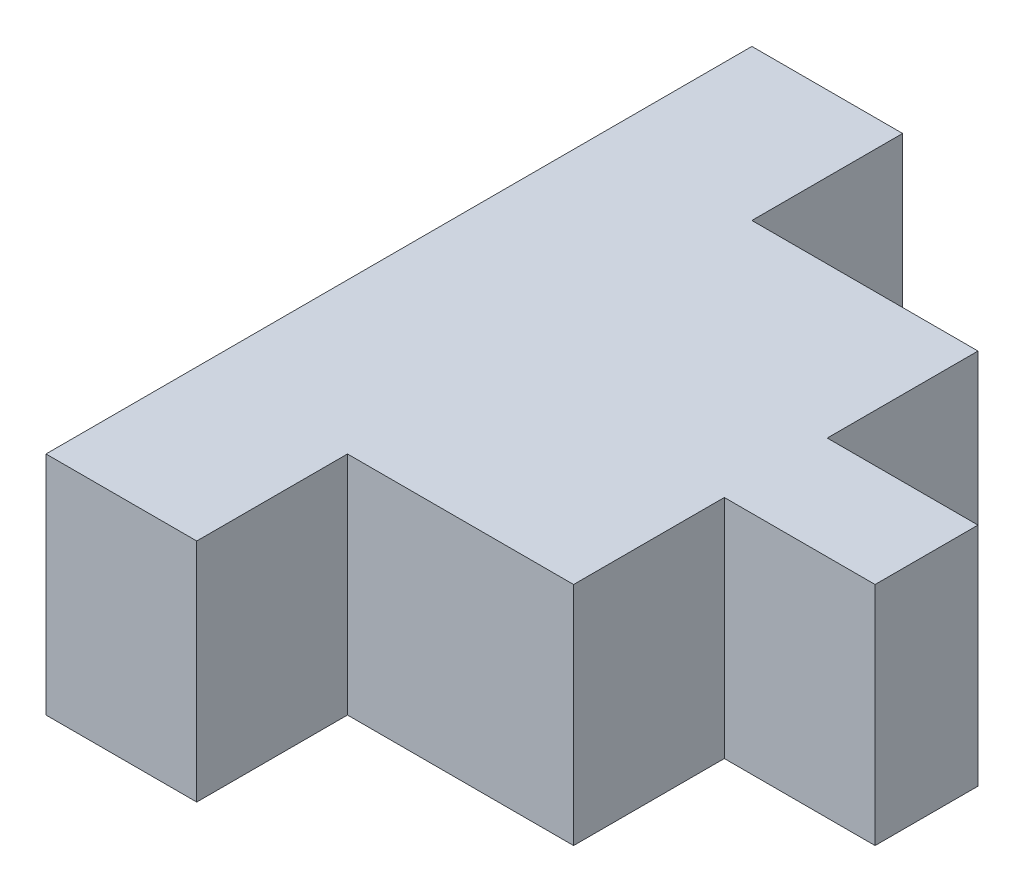
ISO-10303-21;
HEADER;
FILE_DESCRIPTION(('STEP AP214'),'2;1');
FILE_NAME('part.step','',(''),(''),'','','');
FILE_SCHEMA(('AUTOMOTIVE_DESIGN { 1 0 10303 214 1 1 1 1 }'));
ENDSEC;
DATA;
#1=APPLICATION_CONTEXT('core data for automotive mechanical design processes');
#2=APPLICATION_PROTOCOL_DEFINITION('international standard','automotive_design',2000,#1);
#3=PRODUCT_CONTEXT('',#1,'mechanical');
#4=PRODUCT('Part','Part','',(#3));
#5=PRODUCT_RELATED_PRODUCT_CATEGORY('part','',(#4));
#6=PRODUCT_DEFINITION_FORMATION('','',#4);
#7=PRODUCT_DEFINITION_CONTEXT('part definition',#1,'design');
#8=PRODUCT_DEFINITION('design','',#6,#7);
#9=PRODUCT_DEFINITION_SHAPE('','',#8);
#10=(LENGTH_UNIT() NAMED_UNIT(*) SI_UNIT(.MILLI.,.METRE.));
#11=(NAMED_UNIT(*) PLANE_ANGLE_UNIT() SI_UNIT($,.RADIAN.));
#12=(NAMED_UNIT(*) SI_UNIT($,.STERADIAN.) SOLID_ANGLE_UNIT());
#13=UNCERTAINTY_MEASURE_WITH_UNIT(LENGTH_MEASURE(1.E-05),#10,'distance_accuracy_value','');
#14=(GEOMETRIC_REPRESENTATION_CONTEXT(3) GLOBAL_UNCERTAINTY_ASSIGNED_CONTEXT((#13)) GLOBAL_UNIT_ASSIGNED_CONTEXT((#10,
#11,#12)) REPRESENTATION_CONTEXT('',''));
#15=CARTESIAN_POINT('',(0.,0.,0.));
#16=DIRECTION('',(0.,0.,1.));
#17=DIRECTION('',(1.,0.,0.));
#18=AXIS2_PLACEMENT_3D('',#15,#16,#17);
#19=CARTESIAN_POINT('',(0.,76.2,-237.885247541257));
#20=DIRECTION('',(1.,0.,0.));
#21=DIRECTION('',(0.,0.,-1.));
#22=AXIS2_PLACEMENT_3D('',#19,#20,#21);
#23=PLANE('',#22);
#24=DIRECTION('',(0.,0.,1.));
#25=VECTOR('',#24,1.);
#26=CARTESIAN_POINT('',(0.,0.,-237.885247541257));
#27=LINE('',#26,#25);
#28=CARTESIAN_POINT('',(0.,0.,-237.885247541257));
#29=VERTEX_POINT('',#28);
#30=CARTESIAN_POINT('',(0.,0.,0.));
#31=VERTEX_POINT('',#30);
#32=EDGE_CURVE('E168',#29,#31,#27,.T.);
#33=ORIENTED_EDGE('',*,*,#32,.T.);
#34=DIRECTION('',(0.,-1.,0.));
#35=VECTOR('',#34,1.);
#36=CARTESIAN_POINT('',(0.,76.2,0.));
#37=LINE('',#36,#35);
#38=CARTESIAN_POINT('',(0.,76.2,0.));
#39=VERTEX_POINT('',#38);
#40=EDGE_CURVE('E11',#39,#31,#37,.T.);
#41=ORIENTED_EDGE('',*,*,#40,.F.);
#42=DIRECTION('',(0.,0.,1.));
#43=VECTOR('',#42,1.);
#44=CARTESIAN_POINT('',(0.,76.2,-237.885247541257));
#45=LINE('',#44,#43);
#46=CARTESIAN_POINT('',(0.,76.2,-237.885247541257));
#47=VERTEX_POINT('',#46);
#48=EDGE_CURVE('E202',#47,#39,#45,.T.);
#49=ORIENTED_EDGE('',*,*,#48,.F.);
#50=DIRECTION('',(0.,-1.,0.));
#51=VECTOR('',#50,1.);
#52=CARTESIAN_POINT('',(0.,76.2,-237.885247541257));
#53=LINE('',#52,#51);
#54=EDGE_CURVE('E164',#47,#29,#53,.T.);
#55=ORIENTED_EDGE('',*,*,#54,.T.);
#56=EDGE_LOOP('',(#33,#41,#49,#55));
#57=FACE_BOUND('',#56,.T.);
#58=ADVANCED_FACE('F43',(#57),#23,.F.);
#59=CARTESIAN_POINT('',(0.,76.2,0.));
#60=DIRECTION('',(0.,0.,-1.));
#61=DIRECTION('',(-1.,0.,0.));
#62=AXIS2_PLACEMENT_3D('',#59,#60,#61);
#63=PLANE('',#62);
#64=DIRECTION('',(1.,0.,0.));
#65=VECTOR('',#64,1.);
#66=CARTESIAN_POINT('',(0.,0.,0.));
#67=LINE('',#66,#65);
#68=CARTESIAN_POINT('',(50.8,0.,0.));
#69=VERTEX_POINT('',#68);
#70=EDGE_CURVE('E172',#31,#69,#67,.T.);
#71=ORIENTED_EDGE('',*,*,#70,.T.);
#72=DIRECTION('',(0.,-1.,0.));
#73=VECTOR('',#72,1.);
#74=CARTESIAN_POINT('',(50.8,76.2,0.));
#75=LINE('',#74,#73);
#76=CARTESIAN_POINT('',(50.8,76.2,0.));
#77=VERTEX_POINT('',#76);
#78=EDGE_CURVE('E52',#77,#69,#75,.T.);
#79=ORIENTED_EDGE('',*,*,#78,.F.);
#80=DIRECTION('',(1.,0.,0.));
#81=VECTOR('',#80,1.);
#82=CARTESIAN_POINT('',(0.,76.2,0.));
#83=LINE('',#82,#81);
#84=EDGE_CURVE('E115',#39,#77,#83,.T.);
#85=ORIENTED_EDGE('',*,*,#84,.F.);
#86=ORIENTED_EDGE('',*,*,#40,.T.);
#87=EDGE_LOOP('',(#71,#79,#85,#86));
#88=FACE_BOUND('',#87,.T.);
#89=ADVANCED_FACE('F296',(#88),#63,.F.);
#90=CARTESIAN_POINT('',(50.8,76.2,0.));
#91=DIRECTION('',(-1.,0.,0.));
#92=DIRECTION('',(0.,0.,1.));
#93=AXIS2_PLACEMENT_3D('',#90,#91,#92);
#94=PLANE('',#93);
#95=DIRECTION('',(0.,0.,-1.));
#96=VECTOR('',#95,1.);
#97=CARTESIAN_POINT('',(50.8,0.,0.));
#98=LINE('',#97,#96);
#99=CARTESIAN_POINT('',(50.8,0.,-50.8));
#100=VERTEX_POINT('',#99);
#101=EDGE_CURVE('E175',#69,#100,#98,.T.);
#102=ORIENTED_EDGE('',*,*,#101,.T.);
#103=DIRECTION('',(0.,-1.,0.));
#104=VECTOR('',#103,1.);
#105=CARTESIAN_POINT('',(50.8,76.2,-50.8));
#106=LINE('',#105,#104);
#107=CARTESIAN_POINT('',(50.8,76.2,-50.8));
#108=VERTEX_POINT('',#107);
#109=EDGE_CURVE('E229',#108,#100,#106,.T.);
#110=ORIENTED_EDGE('',*,*,#109,.F.);
#111=DIRECTION('',(0.,0.,-1.));
#112=VECTOR('',#111,1.);
#113=CARTESIAN_POINT('',(50.8,76.2,0.));
#114=LINE('',#113,#112);
#115=EDGE_CURVE('E239',#77,#108,#114,.T.);
#116=ORIENTED_EDGE('',*,*,#115,.F.);
#117=ORIENTED_EDGE('',*,*,#78,.T.);
#118=EDGE_LOOP('',(#102,#110,#116,#117));
#119=FACE_BOUND('',#118,.T.);
#120=ADVANCED_FACE('F237',(#119),#94,.F.);
#121=CARTESIAN_POINT('',(50.8,76.2,-50.8));
#122=DIRECTION('',(0.,0.,-1.));
#123=DIRECTION('',(-1.,0.,0.));
#124=AXIS2_PLACEMENT_3D('',#121,#122,#123);
#125=PLANE('',#124);
#126=DIRECTION('',(1.,0.,0.));
#127=VECTOR('',#126,1.);
#128=CARTESIAN_POINT('',(50.8,0.,-50.8));
#129=LINE('',#128,#127);
#130=CARTESIAN_POINT('',(127.,0.,-50.8));
#131=VERTEX_POINT('',#130);
#132=EDGE_CURVE('E178',#100,#131,#129,.T.);
#133=ORIENTED_EDGE('',*,*,#132,.T.);
#134=DIRECTION('',(0.,-1.,0.));
#135=VECTOR('',#134,1.);
#136=CARTESIAN_POINT('',(127.,76.2,-50.8));
#137=LINE('',#136,#135);
#138=CARTESIAN_POINT('',(127.,76.2,-50.8));
#139=VERTEX_POINT('',#138);
#140=EDGE_CURVE('E225',#139,#131,#137,.T.);
#141=ORIENTED_EDGE('',*,*,#140,.F.);
#142=DIRECTION('',(1.,0.,0.));
#143=VECTOR('',#142,1.);
#144=CARTESIAN_POINT('',(50.8,76.2,-50.8));
#145=LINE('',#144,#143);
#146=EDGE_CURVE('E258',#108,#139,#145,.T.);
#147=ORIENTED_EDGE('',*,*,#146,.F.);
#148=ORIENTED_EDGE('',*,*,#109,.T.);
#149=EDGE_LOOP('',(#133,#141,#147,#148));
#150=FACE_BOUND('',#149,.T.);
#151=ADVANCED_FACE('F248',(#150),#125,.F.);
#152=CARTESIAN_POINT('',(127.,76.2,-50.8));
#153=DIRECTION('',(-1.,0.,0.));
#154=DIRECTION('',(0.,0.,1.));
#155=AXIS2_PLACEMENT_3D('',#152,#153,#154);
#156=PLANE('',#155);
#157=DIRECTION('',(0.,0.,-1.));
#158=VECTOR('',#157,1.);
#159=CARTESIAN_POINT('',(127.,0.,-50.8));
#160=LINE('',#159,#158);
#161=CARTESIAN_POINT('',(127.,0.,-101.6));
#162=VERTEX_POINT('',#161);
#163=EDGE_CURVE('E181',#131,#162,#160,.T.);
#164=ORIENTED_EDGE('',*,*,#163,.T.);
#165=DIRECTION('',(0.,-1.,0.));
#166=VECTOR('',#165,1.);
#167=CARTESIAN_POINT('',(127.,76.2,-101.6));
#168=LINE('',#167,#166);
#169=CARTESIAN_POINT('',(127.,76.2,-101.6));
#170=VERTEX_POINT('',#169);
#171=EDGE_CURVE('E221',#170,#162,#168,.T.);
#172=ORIENTED_EDGE('',*,*,#171,.F.);
#173=DIRECTION('',(0.,0.,-1.));
#174=VECTOR('',#173,1.);
#175=CARTESIAN_POINT('',(127.,76.2,-50.8));
#176=LINE('',#175,#174);
#177=EDGE_CURVE('E254',#139,#170,#176,.T.);
#178=ORIENTED_EDGE('',*,*,#177,.F.);
#179=ORIENTED_EDGE('',*,*,#140,.T.);
#180=EDGE_LOOP('',(#164,#172,#178,#179));
#181=FACE_BOUND('',#180,.T.);
#182=ADVANCED_FACE('F252',(#181),#156,.F.);
#183=CARTESIAN_POINT('',(127.,76.2,-101.6));
#184=DIRECTION('',(0.,0.,-1.));
#185=DIRECTION('',(-1.,0.,0.));
#186=AXIS2_PLACEMENT_3D('',#183,#184,#185);
#187=PLANE('',#186);
#188=DIRECTION('',(1.,0.,0.));
#189=VECTOR('',#188,1.);
#190=CARTESIAN_POINT('',(127.,0.,-101.6));
#191=LINE('',#190,#189);
#192=CARTESIAN_POINT('',(177.8,0.,-101.6));
#193=VERTEX_POINT('',#192);
#194=EDGE_CURVE('E184',#162,#193,#191,.T.);
#195=ORIENTED_EDGE('',*,*,#194,.T.);
#196=DIRECTION('',(0.,-1.,0.));
#197=VECTOR('',#196,1.);
#198=CARTESIAN_POINT('',(177.8,76.2,-101.6));
#199=LINE('',#198,#197);
#200=CARTESIAN_POINT('',(177.8,76.2,-101.6));
#201=VERTEX_POINT('',#200);
#202=EDGE_CURVE('E217',#201,#193,#199,.T.);
#203=ORIENTED_EDGE('',*,*,#202,.F.);
#204=DIRECTION('',(1.,0.,0.));
#205=VECTOR('',#204,1.);
#206=CARTESIAN_POINT('',(127.,76.2,-101.6));
#207=LINE('',#206,#205);
#208=EDGE_CURVE('E257',#170,#201,#207,.T.);
#209=ORIENTED_EDGE('',*,*,#208,.F.);
#210=ORIENTED_EDGE('',*,*,#171,.T.);
#211=EDGE_LOOP('',(#195,#203,#209,#210));
#212=FACE_BOUND('',#211,.T.);
#213=ADVANCED_FACE('F309',(#212),#187,.F.);
#214=CARTESIAN_POINT('',(177.8,76.2,-101.6));
#215=DIRECTION('',(-1.,0.,0.));
#216=DIRECTION('',(0.,0.,1.));
#217=AXIS2_PLACEMENT_3D('',#214,#215,#216);
#218=PLANE('',#217);
#219=DIRECTION('',(0.,0.,-1.));
#220=VECTOR('',#219,1.);
#221=CARTESIAN_POINT('',(177.8,0.,-101.6));
#222=LINE('',#221,#220);
#223=CARTESIAN_POINT('',(177.8,0.,-136.285247541257));
#224=VERTEX_POINT('',#223);
#225=EDGE_CURVE('E187',#193,#224,#222,.T.);
#226=ORIENTED_EDGE('',*,*,#225,.T.);
#227=DIRECTION('',(0.,-1.,0.));
#228=VECTOR('',#227,1.);
#229=CARTESIAN_POINT('',(177.8,76.2,-136.285247541257));
#230=LINE('',#229,#228);
#231=CARTESIAN_POINT('',(177.8,76.2,-136.285247541257));
#232=VERTEX_POINT('',#231);
#233=EDGE_CURVE('E213',#232,#224,#230,.T.);
#234=ORIENTED_EDGE('',*,*,#233,.F.);
#235=DIRECTION('',(0.,0.,-1.));
#236=VECTOR('',#235,1.);
#237=CARTESIAN_POINT('',(177.8,76.2,-101.6));
#238=LINE('',#237,#236);
#239=EDGE_CURVE('E262',#201,#232,#238,.T.);
#240=ORIENTED_EDGE('',*,*,#239,.F.);
#241=ORIENTED_EDGE('',*,*,#202,.T.);
#242=EDGE_LOOP('',(#226,#234,#240,#241));
#243=FACE_BOUND('',#242,.T.);
#244=ADVANCED_FACE('F312',(#243),#218,.F.);
#245=CARTESIAN_POINT('',(127.,76.2,-136.285247541257));
#246=DIRECTION('',(0.,0.,1.));
#247=DIRECTION('',(1.,0.,0.));
#248=AXIS2_PLACEMENT_3D('',#245,#246,#247);
#249=PLANE('',#248);
#250=DIRECTION('',(-1.,0.,0.));
#251=VECTOR('',#250,1.);
#252=CARTESIAN_POINT('',(127.,0.,-136.285247541257));
#253=LINE('',#252,#251);
#254=CARTESIAN_POINT('',(127.,0.,-136.285247541257));
#255=VERTEX_POINT('',#254);
#256=EDGE_CURVE('E190',#224,#255,#253,.T.);
#257=ORIENTED_EDGE('',*,*,#256,.T.);
#258=DIRECTION('',(0.,-1.,0.));
#259=VECTOR('',#258,1.);
#260=CARTESIAN_POINT('',(127.,76.2,-136.285247541257));
#261=LINE('',#260,#259);
#262=CARTESIAN_POINT('',(127.,76.2,-136.285247541257));
#263=VERTEX_POINT('',#262);
#264=EDGE_CURVE('E209',#263,#255,#261,.T.);
#265=ORIENTED_EDGE('',*,*,#264,.F.);
#266=DIRECTION('',(-1.,0.,0.));
#267=VECTOR('',#266,1.);
#268=CARTESIAN_POINT('',(127.,76.2,-136.285247541257));
#269=LINE('',#268,#267);
#270=EDGE_CURVE('E269',#232,#263,#269,.T.);
#271=ORIENTED_EDGE('',*,*,#270,.F.);
#272=ORIENTED_EDGE('',*,*,#233,.T.);
#273=EDGE_LOOP('',(#257,#265,#271,#272));
#274=FACE_BOUND('',#273,.T.);
#275=ADVANCED_FACE('F277',(#274),#249,.F.);
#276=CARTESIAN_POINT('',(127.,76.2,-187.085247541257));
#277=DIRECTION('',(-1.,0.,0.));
#278=DIRECTION('',(0.,0.,1.));
#279=AXIS2_PLACEMENT_3D('',#276,#277,#278);
#280=PLANE('',#279);
#281=DIRECTION('',(0.,0.,-1.));
#282=VECTOR('',#281,1.);
#283=CARTESIAN_POINT('',(127.,0.,-187.085247541257));
#284=LINE('',#283,#282);
#285=CARTESIAN_POINT('',(127.,0.,-187.085247541257));
#286=VERTEX_POINT('',#285);
#287=EDGE_CURVE('E193',#255,#286,#284,.T.);
#288=ORIENTED_EDGE('',*,*,#287,.T.);
#289=DIRECTION('',(0.,-1.,0.));
#290=VECTOR('',#289,1.);
#291=CARTESIAN_POINT('',(127.,76.2,-187.085247541257));
#292=LINE('',#291,#290);
#293=CARTESIAN_POINT('',(127.,76.2,-187.085247541257));
#294=VERTEX_POINT('',#293);
#295=EDGE_CURVE('E157',#294,#286,#292,.T.);
#296=ORIENTED_EDGE('',*,*,#295,.F.);
#297=DIRECTION('',(0.,0.,-1.));
#298=VECTOR('',#297,1.);
#299=CARTESIAN_POINT('',(127.,76.2,-187.085247541257));
#300=LINE('',#299,#298);
#301=EDGE_CURVE('E146',#263,#294,#300,.T.);
#302=ORIENTED_EDGE('',*,*,#301,.F.);
#303=ORIENTED_EDGE('',*,*,#264,.T.);
#304=EDGE_LOOP('',(#288,#296,#302,#303));
#305=FACE_BOUND('',#304,.T.);
#306=ADVANCED_FACE('F281',(#305),#280,.F.);
#307=CARTESIAN_POINT('',(50.8,76.2,-187.085247541257));
#308=DIRECTION('',(0.,0.,1.));
#309=DIRECTION('',(1.,0.,0.));
#310=AXIS2_PLACEMENT_3D('',#307,#308,#309);
#311=PLANE('',#310);
#312=DIRECTION('',(-1.,0.,0.));
#313=VECTOR('',#312,1.);
#314=CARTESIAN_POINT('',(50.8,0.,-187.085247541257));
#315=LINE('',#314,#313);
#316=CARTESIAN_POINT('',(50.8,0.,-187.085247541257));
#317=VERTEX_POINT('',#316);
#318=EDGE_CURVE('E155',#286,#317,#315,.T.);
#319=ORIENTED_EDGE('',*,*,#318,.T.);
#320=DIRECTION('',(0.,-1.,0.));
#321=VECTOR('',#320,1.);
#322=CARTESIAN_POINT('',(50.8,76.2,-187.085247541257));
#323=LINE('',#322,#321);
#324=CARTESIAN_POINT('',(50.8,76.2,-187.085247541257));
#325=VERTEX_POINT('',#324);
#326=EDGE_CURVE('E152',#325,#317,#323,.T.);
#327=ORIENTED_EDGE('',*,*,#326,.F.);
#328=DIRECTION('',(-1.,0.,0.));
#329=VECTOR('',#328,1.);
#330=CARTESIAN_POINT('',(50.8,76.2,-187.085247541257));
#331=LINE('',#330,#329);
#332=EDGE_CURVE('E140',#294,#325,#331,.T.);
#333=ORIENTED_EDGE('',*,*,#332,.F.);
#334=ORIENTED_EDGE('',*,*,#295,.T.);
#335=EDGE_LOOP('',(#319,#327,#333,#334));
#336=FACE_BOUND('',#335,.T.);
#337=ADVANCED_FACE('F153',(#336),#311,.F.);
#338=CARTESIAN_POINT('',(50.8,76.2,-237.885247541257));
#339=DIRECTION('',(-1.,0.,0.));
#340=DIRECTION('',(0.,0.,1.));
#341=AXIS2_PLACEMENT_3D('',#338,#339,#340);
#342=PLANE('',#341);
#343=DIRECTION('',(0.,0.,-1.));
#344=VECTOR('',#343,1.);
#345=CARTESIAN_POINT('',(50.8,0.,-237.885247541257));
#346=LINE('',#345,#344);
#347=CARTESIAN_POINT('',(50.8,0.,-237.885247541257));
#348=VERTEX_POINT('',#347);
#349=EDGE_CURVE('E101',#317,#348,#346,.T.);
#350=ORIENTED_EDGE('',*,*,#349,.T.);
#351=DIRECTION('',(0.,-1.,0.));
#352=VECTOR('',#351,1.);
#353=CARTESIAN_POINT('',(50.8,76.2,-237.885247541257));
#354=LINE('',#353,#352);
#355=CARTESIAN_POINT('',(50.8,76.2,-237.885247541257));
#356=VERTEX_POINT('',#355);
#357=EDGE_CURVE('E158',#356,#348,#354,.T.);
#358=ORIENTED_EDGE('',*,*,#357,.F.);
#359=DIRECTION('',(0.,0.,-1.));
#360=VECTOR('',#359,1.);
#361=CARTESIAN_POINT('',(50.8,76.2,-237.885247541257));
#362=LINE('',#361,#360);
#363=EDGE_CURVE('E144',#325,#356,#362,.T.);
#364=ORIENTED_EDGE('',*,*,#363,.F.);
#365=ORIENTED_EDGE('',*,*,#326,.T.);
#366=EDGE_LOOP('',(#350,#358,#364,#365));
#367=FACE_BOUND('',#366,.T.);
#368=ADVANCED_FACE('F160',(#367),#342,.F.);
#369=CARTESIAN_POINT('',(0.,76.2,-237.885247541257));
#370=DIRECTION('',(0.,0.,1.));
#371=DIRECTION('',(1.,0.,0.));
#372=AXIS2_PLACEMENT_3D('',#369,#370,#371);
#373=PLANE('',#372);
#374=DIRECTION('',(-1.,0.,0.));
#375=VECTOR('',#374,1.);
#376=CARTESIAN_POINT('',(0.,0.,-237.885247541257));
#377=LINE('',#376,#375);
#378=EDGE_CURVE('E107',#348,#29,#377,.T.);
#379=ORIENTED_EDGE('',*,*,#378,.T.);
#380=ORIENTED_EDGE('',*,*,#54,.F.);
#381=DIRECTION('',(-1.,0.,0.));
#382=VECTOR('',#381,1.);
#383=CARTESIAN_POINT('',(0.,76.2,-237.885247541257));
#384=LINE('',#383,#382);
#385=EDGE_CURVE('E60',#356,#47,#384,.T.);
#386=ORIENTED_EDGE('',*,*,#385,.F.);
#387=ORIENTED_EDGE('',*,*,#357,.T.);
#388=EDGE_LOOP('',(#379,#380,#386,#387));
#389=FACE_BOUND('',#388,.T.);
#390=ADVANCED_FACE('F285',(#389),#373,.F.);
#391=CARTESIAN_POINT('',(0.,76.2,0.));
#392=DIRECTION('',(0.,1.,0.));
#393=DIRECTION('',(0.,0.,1.));
#394=AXIS2_PLACEMENT_3D('',#391,#392,#393);
#395=PLANE('',#394);
#396=ORIENTED_EDGE('',*,*,#48,.T.);
#397=ORIENTED_EDGE('',*,*,#84,.T.);
#398=ORIENTED_EDGE('',*,*,#115,.T.);
#399=ORIENTED_EDGE('',*,*,#146,.T.);
#400=ORIENTED_EDGE('',*,*,#177,.T.);
#401=ORIENTED_EDGE('',*,*,#208,.T.);
#402=ORIENTED_EDGE('',*,*,#239,.T.);
#403=ORIENTED_EDGE('',*,*,#270,.T.);
#404=ORIENTED_EDGE('',*,*,#301,.T.);
#405=ORIENTED_EDGE('',*,*,#332,.T.);
#406=ORIENTED_EDGE('',*,*,#363,.T.);
#407=ORIENTED_EDGE('',*,*,#385,.T.);
#408=EDGE_LOOP('',(#396,#397,#398,#399,#400,#401,#402,#403,#404,#405,#406,#407));
#409=FACE_BOUND('',#408,.T.);
#410=ADVANCED_FACE('F142',(#409),#395,.T.);
#411=CARTESIAN_POINT('',(0.,0.,0.));
#412=DIRECTION('',(0.,1.,0.));
#413=DIRECTION('',(0.,0.,1.));
#414=AXIS2_PLACEMENT_3D('',#411,#412,#413);
#415=PLANE('',#414);
#416=ORIENTED_EDGE('',*,*,#32,.F.);
#417=ORIENTED_EDGE('',*,*,#378,.F.);
#418=ORIENTED_EDGE('',*,*,#349,.F.);
#419=ORIENTED_EDGE('',*,*,#318,.F.);
#420=ORIENTED_EDGE('',*,*,#287,.F.);
#421=ORIENTED_EDGE('',*,*,#256,.F.);
#422=ORIENTED_EDGE('',*,*,#225,.F.);
#423=ORIENTED_EDGE('',*,*,#194,.F.);
#424=ORIENTED_EDGE('',*,*,#163,.F.);
#425=ORIENTED_EDGE('',*,*,#132,.F.);
#426=ORIENTED_EDGE('',*,*,#101,.F.);
#427=ORIENTED_EDGE('',*,*,#70,.F.);
#428=EDGE_LOOP('',(#416,#417,#418,#419,#420,#421,#422,#423,#424,#425,#426,#427));
#429=FACE_BOUND('',#428,.T.);
#430=ADVANCED_FACE('F243',(#429),#415,.F.);
#431=CLOSED_SHELL('',(#58,#89,#120,#151,#182,#213,#244,#275,#306,#337,#368,#390,#410,#430));
#432=MANIFOLD_SOLID_BREP('B2',#431);
#433=ADVANCED_BREP_SHAPE_REPRESENTATION('',(#18,#432),#14);
#434=SHAPE_DEFINITION_REPRESENTATION(#9,#433);
ENDSEC;
END-ISO-10303-21;
